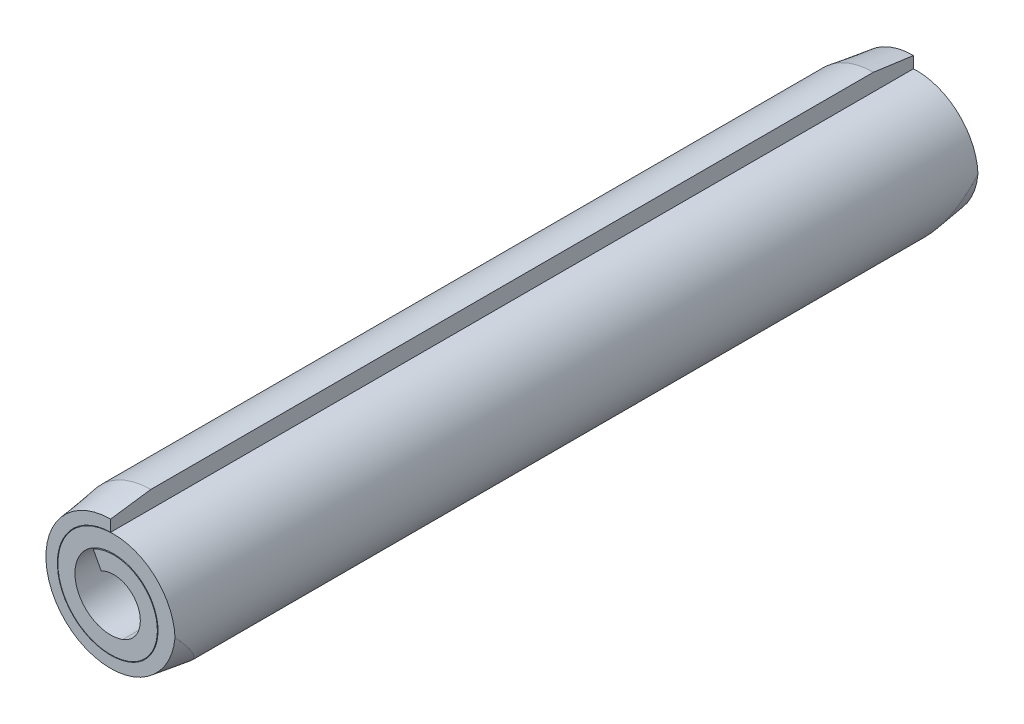
ISO-10303-21;
HEADER;
FILE_DESCRIPTION(('STEP AP214'),'2;1');
FILE_NAME('part.step','',(''),(''),'','','');
FILE_SCHEMA(('AUTOMOTIVE_DESIGN { 1 0 10303 214 1 1 1 1 }'));
ENDSEC;
DATA;
#1=APPLICATION_CONTEXT('core data for automotive mechanical design processes');
#2=APPLICATION_PROTOCOL_DEFINITION('international standard','automotive_design',2000,#1);
#3=PRODUCT_CONTEXT('',#1,'mechanical');
#4=PRODUCT('Part','Part','',(#3));
#5=PRODUCT_RELATED_PRODUCT_CATEGORY('part','',(#4));
#6=PRODUCT_DEFINITION_FORMATION('','',#4);
#7=PRODUCT_DEFINITION_CONTEXT('part definition',#1,'design');
#8=PRODUCT_DEFINITION('design','',#6,#7);
#9=PRODUCT_DEFINITION_SHAPE('','',#8);
#10=(LENGTH_UNIT() NAMED_UNIT(*) SI_UNIT(.MILLI.,.METRE.));
#11=(NAMED_UNIT(*) PLANE_ANGLE_UNIT() SI_UNIT($,.RADIAN.));
#12=(NAMED_UNIT(*) SI_UNIT($,.STERADIAN.) SOLID_ANGLE_UNIT());
#13=UNCERTAINTY_MEASURE_WITH_UNIT(LENGTH_MEASURE(1.E-05),#10,'distance_accuracy_value','');
#14=(GEOMETRIC_REPRESENTATION_CONTEXT(3) GLOBAL_UNCERTAINTY_ASSIGNED_CONTEXT((#13)) GLOBAL_UNIT_ASSIGNED_CONTEXT((#10,
#11,#12)) REPRESENTATION_CONTEXT('',''));
#15=CARTESIAN_POINT('',(0.,0.,0.));
#16=DIRECTION('',(0.,0.,1.));
#17=DIRECTION('',(1.,0.,0.));
#18=AXIS2_PLACEMENT_3D('',#15,#16,#17);
#19=CARTESIAN_POINT('',(-0.211085830625034,0.338291437783564,-9.));
#20=DIRECTION('',(0.883353817881994,0.468706765935062,0.));
#21=DIRECTION('',(-0.468706765935062,0.883353817881994,0.));
#22=AXIS2_PLACEMENT_3D('',#19,#20,#21);
#23=PLANE('',#22);
#24=DIRECTION('',(0.,0.,1.));
#25=VECTOR('',#24,1.);
#26=CARTESIAN_POINT('',(-0.390102521039357,0.675677386600868,-9.));
#27=LINE('',#26,#25);
#28=CARTESIAN_POINT('',(-0.390102521039357,0.675677386600868,-9.));
#29=VERTEX_POINT('',#28);
#30=CARTESIAN_POINT('',(-0.390102521039357,0.675677386600868,9.));
#31=VERTEX_POINT('',#30);
#32=EDGE_CURVE('E243',#29,#31,#27,.T.);
#33=ORIENTED_EDGE('',*,*,#32,.F.);
#34=DIRECTION('',(-0.468706765935062,0.883353817881994,0.));
#35=VECTOR('',#34,1.);
#36=CARTESIAN_POINT('',(-0.211085830625034,0.338291437783564,-9.));
#37=LINE('',#36,#35);
#38=CARTESIAN_POINT('',(-0.211085830625034,0.338291437783564,-9.));
#39=VERTEX_POINT('',#38);
#40=EDGE_CURVE('E126',#39,#29,#37,.T.);
#41=ORIENTED_EDGE('',*,*,#40,.F.);
#42=DIRECTION('',(0.,0.,1.));
#43=VECTOR('',#42,1.);
#44=CARTESIAN_POINT('',(-0.211085830625034,0.338291437783564,-9.));
#45=LINE('',#44,#43);
#46=CARTESIAN_POINT('',(-0.211085830625034,0.338291437783564,9.));
#47=VERTEX_POINT('',#46);
#48=EDGE_CURVE('E110',#47,#39,#45,.F.);
#49=ORIENTED_EDGE('',*,*,#48,.F.);
#50=DIRECTION('',(-0.468706765935062,0.883353817881994,0.));
#51=VECTOR('',#50,1.);
#52=CARTESIAN_POINT('',(-0.211085830625034,0.338291437783564,9.));
#53=LINE('',#52,#51);
#54=EDGE_CURVE('E117',#31,#47,#53,.F.);
#55=ORIENTED_EDGE('',*,*,#54,.F.);
#56=EDGE_LOOP('',(#33,#41,#49,#55));
#57=FACE_BOUND('',#56,.T.);
#58=ADVANCED_FACE('F17',(#57),#23,.F.);
#59=CARTESIAN_POINT('',(0.0689996919525346,-0.189575095588917,-9.));
#60=DIRECTION('',(0.,0.,1.));
#61=DIRECTION('',(1.,0.,0.));
#62=AXIS2_PLACEMENT_3D('',#59,#60,#61);
#63=CYLINDRICAL_SURFACE('',#62,0.597570897059278);
#64=CARTESIAN_POINT('',(0.0689996919525346,-0.189575095588917,-9.));
#65=DIRECTION('',(0.,0.,1.));
#66=DIRECTION('',(1.,0.,0.));
#67=AXIS2_PLACEMENT_3D('',#64,#65,#66);
#68=CIRCLE('',#67,0.597570897059278);
#69=CARTESIAN_POINT('',(0.273380975811996,-0.751108057951937,-9.));
#70=VERTEX_POINT('',#69);
#71=EDGE_CURVE('E102',#70,#39,#68,.T.);
#72=ORIENTED_EDGE('',*,*,#71,.F.);
#73=DIRECTION('',(0.,0.,1.));
#74=VECTOR('',#73,1.);
#75=CARTESIAN_POINT('',(0.273380975811998,-0.751108057951936,-9.));
#76=LINE('',#75,#74);
#77=CARTESIAN_POINT('',(0.273380975811996,-0.751108057951937,9.));
#78=VERTEX_POINT('',#77);
#79=EDGE_CURVE('E113',#70,#78,#76,.T.);
#80=ORIENTED_EDGE('',*,*,#79,.T.);
#81=CARTESIAN_POINT('',(0.0689996919525346,-0.189575095588917,9.));
#82=DIRECTION('',(0.,0.,1.));
#83=DIRECTION('',(1.,0.,0.));
#84=AXIS2_PLACEMENT_3D('',#81,#82,#83);
#85=CIRCLE('',#84,0.597570897059278);
#86=EDGE_CURVE('E20',#47,#78,#85,.F.);
#87=ORIENTED_EDGE('',*,*,#86,.F.);
#88=ORIENTED_EDGE('',*,*,#48,.T.);
#89=EDGE_LOOP('',(#72,#80,#87,#88));
#90=FACE_BOUND('',#89,.T.);
#91=ADVANCED_FACE('F108',(#90),#63,.F.);
#92=CARTESIAN_POINT('',(0.,0.,-9.));
#93=DIRECTION('',(0.,0.,1.));
#94=DIRECTION('',(1.,0.,0.));
#95=AXIS2_PLACEMENT_3D('',#92,#93,#94);
#96=CYLINDRICAL_SURFACE('',#95,1.18125);
#97=CARTESIAN_POINT('',(0.,0.,-9.));
#98=DIRECTION('',(0.,0.,1.));
#99=DIRECTION('',(1.,0.,0.));
#100=AXIS2_PLACEMENT_3D('',#97,#98,#99);
#101=CIRCLE('',#100,1.18125);
#102=CARTESIAN_POINT('',(-0.404011294303447,1.11001190830335,-9.));
#103=VERTEX_POINT('',#102);
#104=CARTESIAN_POINT('',(0.404011294303443,-1.11001190830336,-9.));
#105=VERTEX_POINT('',#104);
#106=EDGE_CURVE('E263',#103,#105,#101,.T.);
#107=ORIENTED_EDGE('',*,*,#106,.T.);
#108=DIRECTION('',(0.,0.,1.));
#109=VECTOR('',#108,1.);
#110=CARTESIAN_POINT('',(0.404011294303446,-1.11001190830335,-9.));
#111=LINE('',#110,#109);
#112=CARTESIAN_POINT('',(0.404011294303443,-1.11001190830336,9.));
#113=VERTEX_POINT('',#112);
#114=EDGE_CURVE('E245',#105,#113,#111,.T.);
#115=ORIENTED_EDGE('',*,*,#114,.T.);
#116=CARTESIAN_POINT('',(0.,0.,9.));
#117=DIRECTION('',(0.,0.,1.));
#118=DIRECTION('',(1.,0.,0.));
#119=AXIS2_PLACEMENT_3D('',#116,#117,#118);
#120=CIRCLE('',#119,1.18125);
#121=CARTESIAN_POINT('',(-0.404011294303447,1.11001190830335,9.));
#122=VERTEX_POINT('',#121);
#123=EDGE_CURVE('E255',#122,#113,#120,.T.);
#124=ORIENTED_EDGE('',*,*,#123,.F.);
#125=DIRECTION('',(0.,0.,1.));
#126=VECTOR('',#125,1.);
#127=CARTESIAN_POINT('',(-0.404011294303447,1.11001190830335,-9.));
#128=LINE('',#127,#126);
#129=EDGE_CURVE('E234',#103,#122,#128,.T.);
#130=ORIENTED_EDGE('',*,*,#129,.F.);
#131=EDGE_LOOP('',(#107,#115,#124,#130));
#132=FACE_BOUND('',#131,.T.);
#133=ADVANCED_FACE('F183',(#132),#96,.T.);
#134=CARTESIAN_POINT('',(0.0689996919525346,-0.189575095588917,-9.));
#135=DIRECTION('',(0.,0.,1.));
#136=DIRECTION('',(1.,0.,0.));
#137=AXIS2_PLACEMENT_3D('',#134,#135,#136);
#138=CYLINDRICAL_SURFACE('',#137,0.979508397059278);
#139=ORIENTED_EDGE('',*,*,#32,.T.);
#140=CARTESIAN_POINT('',(0.0689996919525346,-0.189575095588917,9.));
#141=DIRECTION('',(0.,0.,1.));
#142=DIRECTION('',(1.,0.,0.));
#143=AXIS2_PLACEMENT_3D('',#140,#141,#142);
#144=CIRCLE('',#143,0.979508397059278);
#145=EDGE_CURVE('E122',#113,#31,#144,.T.);
#146=ORIENTED_EDGE('',*,*,#145,.F.);
#147=ORIENTED_EDGE('',*,*,#114,.F.);
#148=CARTESIAN_POINT('',(0.0689996919525346,-0.189575095588917,-9.));
#149=DIRECTION('',(0.,0.,1.));
#150=DIRECTION('',(1.,0.,0.));
#151=AXIS2_PLACEMENT_3D('',#148,#149,#150);
#152=CIRCLE('',#151,0.979508397059278);
#153=EDGE_CURVE('E265',#105,#29,#152,.T.);
#154=ORIENTED_EDGE('',*,*,#153,.T.);
#155=EDGE_LOOP('',(#139,#146,#147,#154));
#156=FACE_BOUND('',#155,.T.);
#157=ADVANCED_FACE('F179',(#156),#138,.T.);
#158=CARTESIAN_POINT('',(0.,0.,-9.));
#159=DIRECTION('',(0.,0.,1.));
#160=DIRECTION('',(1.,0.,0.));
#161=AXIS2_PLACEMENT_3D('',#158,#159,#160);
#162=CYLINDRICAL_SURFACE('',#161,0.799312499999999);
#163=ORIENTED_EDGE('',*,*,#79,.F.);
#164=CARTESIAN_POINT('',(0.,0.,-9.));
#165=DIRECTION('',(0.,0.,1.));
#166=DIRECTION('',(1.,0.,0.));
#167=AXIS2_PLACEMENT_3D('',#164,#165,#166);
#168=CIRCLE('',#167,0.799312499999999);
#169=CARTESIAN_POINT('',(-0.273380975811999,0.751108057951935,-9.));
#170=VERTEX_POINT('',#169);
#171=EDGE_CURVE('E268',#70,#170,#168,.F.);
#172=ORIENTED_EDGE('',*,*,#171,.T.);
#173=DIRECTION('',(0.,0.,1.));
#174=VECTOR('',#173,1.);
#175=CARTESIAN_POINT('',(-0.273380975811999,0.751108057951935,-9.));
#176=LINE('',#175,#174);
#177=CARTESIAN_POINT('',(-0.273380975811999,0.751108057951935,9.));
#178=VERTEX_POINT('',#177);
#179=EDGE_CURVE('E237',#170,#178,#176,.T.);
#180=ORIENTED_EDGE('',*,*,#179,.T.);
#181=CARTESIAN_POINT('',(0.,0.,9.));
#182=DIRECTION('',(0.,0.,1.));
#183=DIRECTION('',(1.,0.,0.));
#184=AXIS2_PLACEMENT_3D('',#181,#182,#183);
#185=CIRCLE('',#184,0.799312499999999);
#186=EDGE_CURVE('E258',#78,#178,#185,.F.);
#187=ORIENTED_EDGE('',*,*,#186,.F.);
#188=EDGE_LOOP('',(#163,#172,#180,#187));
#189=FACE_BOUND('',#188,.T.);
#190=ADVANCED_FACE('F175',(#189),#162,.F.);
#191=CARTESIAN_POINT('',(0.0673352157172413,-0.185001984717226,-9.));
#192=DIRECTION('',(0.,0.,1.));
#193=DIRECTION('',(1.,0.,0.));
#194=AXIS2_PLACEMENT_3D('',#191,#192,#193);
#195=CYLINDRICAL_SURFACE('',#194,0.996187499999999);
#196=CARTESIAN_POINT('',(0.0673352157172413,-0.185001984717226,-9.));
#197=DIRECTION('',(0.,0.,1.));
#198=DIRECTION('',(1.,0.,0.));
#199=AXIS2_PLACEMENT_3D('',#196,#197,#198);
#200=CIRCLE('',#199,0.996187499999999);
#201=CARTESIAN_POINT('',(0.408051407246481,-1.12111202738639,-9.));
#202=VERTEX_POINT('',#201);
#203=EDGE_CURVE('E270',#170,#202,#200,.F.);
#204=ORIENTED_EDGE('',*,*,#203,.T.);
#205=DIRECTION('',(0.,0.,1.));
#206=VECTOR('',#205,1.);
#207=CARTESIAN_POINT('',(0.408051407246481,-1.12111202738639,-9.));
#208=LINE('',#207,#206);
#209=CARTESIAN_POINT('',(0.408051407246481,-1.12111202738639,9.));
#210=VERTEX_POINT('',#209);
#211=EDGE_CURVE('E231',#202,#210,#208,.T.);
#212=ORIENTED_EDGE('',*,*,#211,.T.);
#213=CARTESIAN_POINT('',(0.0673352157172413,-0.185001984717226,9.));
#214=DIRECTION('',(0.,0.,1.));
#215=DIRECTION('',(1.,0.,0.));
#216=AXIS2_PLACEMENT_3D('',#213,#214,#215);
#217=CIRCLE('',#216,0.996187499999999);
#218=EDGE_CURVE('E232',#178,#210,#217,.F.);
#219=ORIENTED_EDGE('',*,*,#218,.F.);
#220=ORIENTED_EDGE('',*,*,#179,.F.);
#221=EDGE_LOOP('',(#204,#212,#219,#220));
#222=FACE_BOUND('',#221,.T.);
#223=ADVANCED_FACE('F172',(#222),#195,.F.);
#224=CARTESIAN_POINT('',(0.0689996919525346,-0.189575095588917,9.));
#225=DIRECTION('',(0.,0.,1.));
#226=DIRECTION('',(1.,0.,0.));
#227=AXIS2_PLACEMENT_3D('',#224,#225,#226);
#228=PLANE('',#227);
#229=CARTESIAN_POINT('',(0.,0.,9.));
#230=DIRECTION('',(0.,0.,1.));
#231=DIRECTION('',(1.,0.,0.));
#232=AXIS2_PLACEMENT_3D('',#229,#230,#231);
#233=CIRCLE('',#232,1.1930625);
#234=CARTESIAN_POINT('',(0.,1.1930625,9.));
#235=VERTEX_POINT('',#234);
#236=EDGE_CURVE('E239',#210,#235,#233,.F.);
#237=ORIENTED_EDGE('',*,*,#236,.T.);
#238=DIRECTION('',(0.,1.,0.));
#239=VECTOR('',#238,1.);
#240=CARTESIAN_POINT('',(0.,-0.189575095588917,9.));
#241=LINE('',#240,#239);
#242=CARTESIAN_POINT('',(0.,1.45000000000275,9.00000000000728));
#243=VERTEX_POINT('',#242);
#244=EDGE_CURVE('E230',#235,#243,#241,.T.);
#245=ORIENTED_EDGE('',*,*,#244,.T.);
#246=CARTESIAN_POINT('',(0.,0.,9.00000000001455));
#247=DIRECTION('',(0.,0.,-1.));
#248=DIRECTION('',(-1.,0.,0.));
#249=AXIS2_PLACEMENT_3D('',#246,#247,#248);
#250=CIRCLE('',#249,1.4500000000055);
#251=CARTESIAN_POINT('',(1.44429938850018,-0.12844950911095,8.99999999999959));
#252=VERTEX_POINT('',#251);
#253=EDGE_CURVE('E135',#252,#243,#250,.T.);
#254=ORIENTED_EDGE('',*,*,#253,.F.);
#255=CARTESIAN_POINT('',(0.0673352157172413,-0.185001984717226,9.));
#256=DIRECTION('',(0.,0.,1.));
#257=DIRECTION('',(1.,0.,0.));
#258=AXIS2_PLACEMENT_3D('',#255,#256,#257);
#259=CIRCLE('',#258,1.378125);
#260=EDGE_CURVE('E236',#252,#122,#259,.T.);
#261=ORIENTED_EDGE('',*,*,#260,.T.);
#262=ORIENTED_EDGE('',*,*,#123,.T.);
#263=ORIENTED_EDGE('',*,*,#145,.T.);
#264=ORIENTED_EDGE('',*,*,#54,.T.);
#265=ORIENTED_EDGE('',*,*,#86,.T.);
#266=ORIENTED_EDGE('',*,*,#186,.T.);
#267=ORIENTED_EDGE('',*,*,#218,.T.);
#268=EDGE_LOOP('',(#237,#245,#254,#261,#262,#263,#264,#265,#266,#267));
#269=FACE_BOUND('',#268,.T.);
#270=ADVANCED_FACE('F120',(#269),#228,.T.);
#271=CARTESIAN_POINT('',(0.,0.,-9.));
#272=DIRECTION('',(0.,0.,1.));
#273=DIRECTION('',(1.,0.,0.));
#274=AXIS2_PLACEMENT_3D('',#271,#272,#273);
#275=CYLINDRICAL_SURFACE('',#274,1.1930625);
#276=ORIENTED_EDGE('',*,*,#211,.F.);
#277=CARTESIAN_POINT('',(0.,0.,-9.));
#278=DIRECTION('',(0.,0.,1.));
#279=DIRECTION('',(1.,0.,0.));
#280=AXIS2_PLACEMENT_3D('',#277,#278,#279);
#281=CIRCLE('',#280,1.1930625);
#282=CARTESIAN_POINT('',(0.,1.1930625,-9.));
#283=VERTEX_POINT('',#282);
#284=EDGE_CURVE('E272',#202,#283,#281,.F.);
#285=ORIENTED_EDGE('',*,*,#284,.T.);
#286=DIRECTION('',(0.,0.,1.));
#287=VECTOR('',#286,1.);
#288=CARTESIAN_POINT('',(0.,1.1930625,-9.));
#289=LINE('',#288,#287);
#290=EDGE_CURVE('E138',#283,#235,#289,.T.);
#291=ORIENTED_EDGE('',*,*,#290,.T.);
#292=ORIENTED_EDGE('',*,*,#236,.F.);
#293=EDGE_LOOP('',(#276,#285,#291,#292));
#294=FACE_BOUND('',#293,.T.);
#295=ADVANCED_FACE('F166',(#294),#275,.F.);
#296=CARTESIAN_POINT('',(0.0689996919525346,-0.189575095588917,-9.));
#297=DIRECTION('',(0.,0.,1.));
#298=DIRECTION('',(1.,0.,0.));
#299=AXIS2_PLACEMENT_3D('',#296,#297,#298);
#300=PLANE('',#299);
#301=CARTESIAN_POINT('',(0.0673352157172413,-0.185001984717226,-9.));
#302=DIRECTION('',(0.,0.,1.));
#303=DIRECTION('',(1.,0.,0.));
#304=AXIS2_PLACEMENT_3D('',#301,#302,#303);
#305=CIRCLE('',#304,1.378125);
#306=CARTESIAN_POINT('',(1.4442993884941,-0.128449509048925,-8.99999999999183));
#307=VERTEX_POINT('',#306);
#308=EDGE_CURVE('E273',#307,#103,#305,.T.);
#309=ORIENTED_EDGE('',*,*,#308,.F.);
#310=CARTESIAN_POINT('',(0.,0.,-9.00000000000728));
#311=DIRECTION('',(0.,0.,1.));
#312=DIRECTION('',(1.,0.,0.));
#313=AXIS2_PLACEMENT_3D('',#310,#311,#312);
#314=CIRCLE('',#313,1.44999999999388);
#315=CARTESIAN_POINT('',(0.,1.44999999999827,-9.0000000000357));
#316=VERTEX_POINT('',#315);
#317=EDGE_CURVE('E131',#316,#307,#314,.T.);
#318=ORIENTED_EDGE('',*,*,#317,.F.);
#319=DIRECTION('',(0.,-1.,0.));
#320=VECTOR('',#319,1.);
#321=CARTESIAN_POINT('',(0.,1.575,-9.));
#322=LINE('',#321,#320);
#323=EDGE_CURVE('E134',#316,#283,#322,.T.);
#324=ORIENTED_EDGE('',*,*,#323,.T.);
#325=ORIENTED_EDGE('',*,*,#284,.F.);
#326=ORIENTED_EDGE('',*,*,#203,.F.);
#327=ORIENTED_EDGE('',*,*,#171,.F.);
#328=ORIENTED_EDGE('',*,*,#71,.T.);
#329=ORIENTED_EDGE('',*,*,#40,.T.);
#330=ORIENTED_EDGE('',*,*,#153,.F.);
#331=ORIENTED_EDGE('',*,*,#106,.F.);
#332=EDGE_LOOP('',(#309,#318,#324,#325,#326,#327,#328,#329,#330,#331));
#333=FACE_BOUND('',#332,.T.);
#334=ADVANCED_FACE('F161',(#333),#300,.F.);
#335=CARTESIAN_POINT('',(0.0673352157172413,-0.185001984717226,-9.));
#336=DIRECTION('',(0.,0.,1.));
#337=DIRECTION('',(1.,0.,0.));
#338=AXIS2_PLACEMENT_3D('',#335,#336,#337);
#339=CYLINDRICAL_SURFACE('',#338,1.378125);
#340=CARTESIAN_POINT('',(0.538681725737929,-1.4800158777378,8.10000000013377));
#341=CARTESIAN_POINT('',(0.568457575291803,-1.46918224784146,8.09999713101628));
#342=CARTESIAN_POINT('',(0.597839499243149,-1.45732031822733,8.10098429130596));
#343=CARTESIAN_POINT('',(0.655594090129832,-1.43166818089949,8.10490183378926));
#344=CARTESIAN_POINT('',(0.683967372478445,-1.41787917521204,8.10783100887027));
#345=CARTESIAN_POINT('',(0.766848538637026,-1.3740290993974,8.11941549407509));
#346=CARTESIAN_POINT('',(0.819605068856571,-1.341305849971,8.13086913587589));
#347=CARTESIAN_POINT('',(0.91886350255145,-1.27029254251756,8.16049297442889));
#348=CARTESIAN_POINT('',(0.96537807650679,-1.23201410026104,8.17864927546407));
#349=CARTESIAN_POINT('',(1.05175685498751,-1.15125624233099,8.22072898540391));
#350=CARTESIAN_POINT('',(1.09160909000056,-1.10876947946312,8.24466258924759));
#351=CARTESIAN_POINT('',(1.17710475141354,-1.00570152050876,8.30644462732102));
#352=CARTESIAN_POINT('',(1.21994637778338,-0.943964007703288,8.34623810526463));
#353=CARTESIAN_POINT('',(1.29370887157189,-0.817925509819062,8.43232155733951));
#354=CARTESIAN_POINT('',(1.32460475054872,-0.753619458310551,8.47862487616102));
#355=CARTESIAN_POINT('',(1.38325770469748,-0.604341069078676,8.59105648021862));
#356=CARTESIAN_POINT('',(1.40709324711908,-0.519124290582799,8.65888893123065));
#357=CARTESIAN_POINT('',(1.43818930890035,-0.350375391470358,8.79985561180811));
#358=CARTESIAN_POINT('',(1.44546431248168,-0.266841862084883,8.8729851506042));
#359=CARTESIAN_POINT('',(1.44545926734968,-0.166056720468179,8.96510866235372));
#360=CARTESIAN_POINT('',(1.4450682430972,-0.147202216422362,8.98251560369966));
#361=CARTESIAN_POINT('',(1.44429938849984,-0.128449509102625,9.00000000003007));
#362=B_SPLINE_CURVE_WITH_KNOTS('',3,(#340,#341,#342,#343,#344,#345,#346,#347,#348,#349,#350,
#351,#352,#353,#354,#355,#356,#357,#358,#359,#360,#361),.UNSPECIFIED.,.F.,.F.,(4,2,2,2,2,2,2,2,
2,2,4),(0.,0.0949867724274584,0.189914558504254,0.378235945696181,0.566169084306071,
0.754436315914468,1.00814215783727,1.26237587384423,1.59518693674558,1.92770680354278,
2.00468244131286),.UNSPECIFIED.);
#363=CARTESIAN_POINT('',(0.538681725737929,-1.48001587773781,8.10000000006688));
#364=VERTEX_POINT('',#363);
#365=EDGE_CURVE('E139',#364,#252,#362,.T.);
#366=ORIENTED_EDGE('',*,*,#365,.F.);
#367=DIRECTION('',(0.,0.,1.));
#368=VECTOR('',#367,1.);
#369=CARTESIAN_POINT('',(0.538681725737929,-1.48001587773781,-9.));
#370=LINE('',#369,#368);
#371=CARTESIAN_POINT('',(0.538681725738364,-1.480015877739,-8.10000000000521));
#372=VERTEX_POINT('',#371);
#373=EDGE_CURVE('E221',#372,#364,#370,.T.);
#374=ORIENTED_EDGE('',*,*,#373,.F.);
#375=CARTESIAN_POINT('',(0.538681725737928,-1.4800158777378,-8.09999999999733));
#376=CARTESIAN_POINT('',(0.568457575291395,-1.46918224784161,-8.09999713087984));
#377=CARTESIAN_POINT('',(0.597839499242344,-1.45732031822765,-8.10098429116955));
#378=CARTESIAN_POINT('',(0.65559409012825,-1.43166818090023,-8.10490183365294));
#379=CARTESIAN_POINT('',(0.683967372476484,-1.41787917521301,-8.10783100873402));
#380=CARTESIAN_POINT('',(0.766848538633942,-1.37402909939916,-8.11941549393909));
#381=CARTESIAN_POINT('',(0.819605068852773,-1.34130584997342,-8.13086913574014));
#382=CARTESIAN_POINT('',(0.918863502546322,-1.27029254252153,-8.16049297429373));
#383=CARTESIAN_POINT('',(0.965378076501044,-1.23201410026591,-8.17864927532924));
#384=CARTESIAN_POINT('',(1.05175685498068,-1.15125624233788,-8.22072898526982));
#385=CARTESIAN_POINT('',(1.09160908999328,-1.10876947947113,-8.24466258911388));
#386=CARTESIAN_POINT('',(1.17710475140619,-1.00570152051867,-8.30644462718879));
#387=CARTESIAN_POINT('',(1.21994637777631,-0.94396400771397,-8.34623810513363));
#388=CARTESIAN_POINT('',(1.29370887156546,-0.817925509831453,-8.43232155721112));
#389=CARTESIAN_POINT('',(1.32460475054265,-0.753619458323878,-8.478624876034));
#390=CARTESIAN_POINT('',(1.38325770469693,-0.604341069082856,-8.59105648010344));
#391=CARTESIAN_POINT('',(1.40709324712121,-0.519124290576775,-8.65888893112708));
#392=CARTESIAN_POINT('',(1.43818930890405,-0.350375391444716,-8.79985561172889));
#393=CARTESIAN_POINT('',(1.44546431248429,-0.266841862049826,-8.87298515053772));
#394=CARTESIAN_POINT('',(1.44545926734907,-0.166056720423758,-8.96510866230187));
#395=CARTESIAN_POINT('',(1.44506824309597,-0.147202216377404,-8.98251560364947));
#396=CARTESIAN_POINT('',(1.44429938849797,-0.128449509057147,-8.99999999998152));
#397=B_SPLINE_CURVE_WITH_KNOTS('',3,(#375,#376,#377,#378,#379,#380,#381,#382,#383,#384,#385,
#386,#387,#388,#389,#390,#391,#392,#393,#394,#395,#396),.UNSPECIFIED.,.F.,.F.,(4,2,2,2,2,2,2,2,
2,2,4),(0.,0.0949867724261565,0.189914558501646,0.378235945690907,0.566169084298099,
0.754436315903807,1.00814215782707,1.26237587383457,1.59518693678158,1.92770680362454,
2.00468244139919),.UNSPECIFIED.);
#398=EDGE_CURVE('E147',#372,#307,#397,.T.);
#399=ORIENTED_EDGE('',*,*,#398,.T.);
#400=ORIENTED_EDGE('',*,*,#308,.T.);
#401=ORIENTED_EDGE('',*,*,#129,.T.);
#402=ORIENTED_EDGE('',*,*,#260,.F.);
#403=EDGE_LOOP('',(#366,#374,#399,#400,#401,#402));
#404=FACE_BOUND('',#403,.T.);
#405=ADVANCED_FACE('F157',(#404),#339,.T.);
#406=CARTESIAN_POINT('',(0.,0.,8.1000000000131));
#407=DIRECTION('',(0.,0.,-1.));
#408=DIRECTION('',(-1.,0.,0.));
#409=AXIS2_PLACEMENT_3D('',#406,#407,#408);
#410=CONICAL_SURFACE('',#409,1.57500000001676,0.138006023669568);
#411=DIRECTION('',(0.,0.137568371274688,-0.990492273177751));
#412=VECTOR('',#411,1.);
#413=CARTESIAN_POINT('',(0.,1.45,9.));
#414=LINE('',#413,#412);
#415=CARTESIAN_POINT('',(0.,1.57500000000838,8.10000000000656));
#416=VERTEX_POINT('',#415);
#417=EDGE_CURVE('E213',#243,#416,#414,.T.);
#418=ORIENTED_EDGE('',*,*,#417,.T.);
#419=CARTESIAN_POINT('',(0.,0.,8.1));
#420=DIRECTION('',(0.,0.,1.));
#421=DIRECTION('',(1.,0.,0.));
#422=AXIS2_PLACEMENT_3D('',#419,#420,#421);
#423=CIRCLE('',#422,1.575);
#424=EDGE_CURVE('E215',#364,#416,#423,.F.);
#425=ORIENTED_EDGE('',*,*,#424,.F.);
#426=ORIENTED_EDGE('',*,*,#365,.T.);
#427=ORIENTED_EDGE('',*,*,#253,.T.);
#428=EDGE_LOOP('',(#418,#425,#426,#427));
#429=FACE_BOUND('',#428,.T.);
#430=ADVANCED_FACE('F154',(#429),#410,.T.);
#431=CARTESIAN_POINT('',(0.,1.575,-9.));
#432=DIRECTION('',(-1.,0.,0.));
#433=DIRECTION('',(0.,-1.,0.));
#434=AXIS2_PLACEMENT_3D('',#431,#432,#433);
#435=PLANE('',#434);
#436=DIRECTION('',(0.,-0.137568371274689,-0.990492273177752));
#437=VECTOR('',#436,1.);
#438=CARTESIAN_POINT('',(8.48781333205985E-12,69308.255555556,499000.));
#439=LINE('',#438,#437);
#440=CARTESIAN_POINT('',(0.,1.57500000000419,-8.10000000000328));
#441=VERTEX_POINT('',#440);
#442=EDGE_CURVE('E35',#441,#316,#439,.T.);
#443=ORIENTED_EDGE('',*,*,#442,.F.);
#444=DIRECTION('',(0.,0.,1.));
#445=VECTOR('',#444,1.);
#446=CARTESIAN_POINT('',(0.,1.575,-9.));
#447=LINE('',#446,#445);
#448=EDGE_CURVE('E26',#416,#441,#447,.F.);
#449=ORIENTED_EDGE('',*,*,#448,.F.);
#450=ORIENTED_EDGE('',*,*,#417,.F.);
#451=ORIENTED_EDGE('',*,*,#244,.F.);
#452=ORIENTED_EDGE('',*,*,#290,.F.);
#453=ORIENTED_EDGE('',*,*,#323,.F.);
#454=EDGE_LOOP('',(#443,#449,#450,#451,#452,#453));
#455=FACE_BOUND('',#454,.T.);
#456=ADVANCED_FACE('F200',(#455),#435,.F.);
#457=CARTESIAN_POINT('',(0.,0.,-8.10000000018363));
#458=DIRECTION('',(0.,0.,1.));
#459=DIRECTION('',(1.,0.,0.));
#460=AXIS2_PLACEMENT_3D('',#457,#458,#459);
#461=CONICAL_SURFACE('',#460,1.57499999997413,0.138006023662683);
#462=CARTESIAN_POINT('',(0.,0.,-8.1));
#463=DIRECTION('',(0.,0.,1.));
#464=DIRECTION('',(1.,0.,0.));
#465=AXIS2_PLACEMENT_3D('',#462,#463,#464);
#466=CIRCLE('',#465,1.575);
#467=EDGE_CURVE('E11',#441,#372,#466,.T.);
#468=ORIENTED_EDGE('',*,*,#467,.F.);
#469=ORIENTED_EDGE('',*,*,#442,.T.);
#470=ORIENTED_EDGE('',*,*,#317,.T.);
#471=ORIENTED_EDGE('',*,*,#398,.F.);
#472=EDGE_LOOP('',(#468,#469,#470,#471));
#473=FACE_BOUND('',#472,.T.);
#474=ADVANCED_FACE('F194',(#473),#461,.T.);
#475=CARTESIAN_POINT('',(0.,0.,-9.));
#476=DIRECTION('',(0.,0.,1.));
#477=DIRECTION('',(1.,0.,0.));
#478=AXIS2_PLACEMENT_3D('',#475,#476,#477);
#479=CYLINDRICAL_SURFACE('',#478,1.575);
#480=ORIENTED_EDGE('',*,*,#448,.T.);
#481=ORIENTED_EDGE('',*,*,#467,.T.);
#482=ORIENTED_EDGE('',*,*,#373,.T.);
#483=ORIENTED_EDGE('',*,*,#424,.T.);
#484=EDGE_LOOP('',(#480,#481,#482,#483));
#485=FACE_BOUND('',#484,.T.);
#486=ADVANCED_FACE('F192',(#485),#479,.T.);
#487=CLOSED_SHELL('',(#58,#91,#133,#157,#190,#223,#270,#295,#334,#405,#430,#456,#474,#486));
#488=MANIFOLD_SOLID_BREP('B1',#487);
#489=ADVANCED_BREP_SHAPE_REPRESENTATION('',(#18,#488),#14);
#490=SHAPE_DEFINITION_REPRESENTATION(#9,#489);
ENDSEC;
END-ISO-10303-21;
